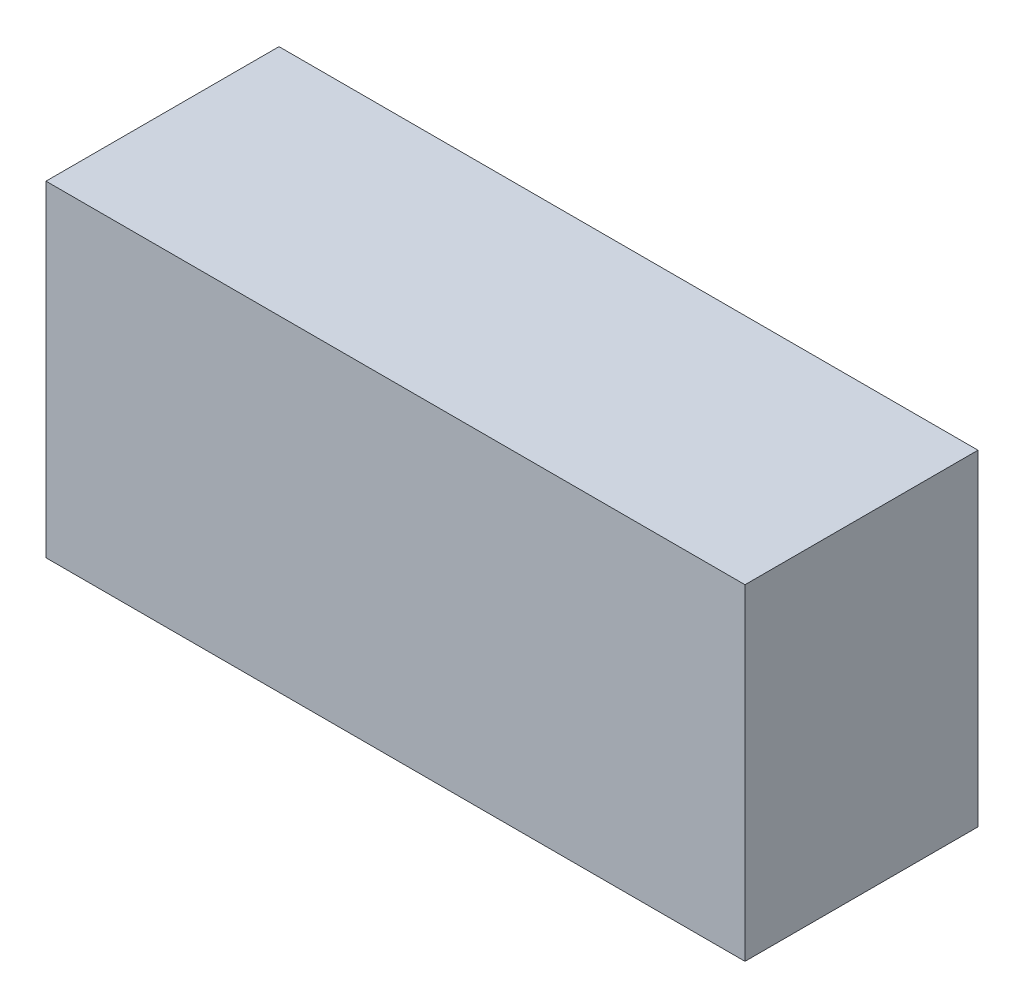
ISO-10303-21;
HEADER;
FILE_DESCRIPTION(('STEP AP214'),'2;1');
FILE_NAME('part.step','',(''),(''),'','','');
FILE_SCHEMA(('AUTOMOTIVE_DESIGN { 1 0 10303 214 1 1 1 1 }'));
ENDSEC;
DATA;
#1=APPLICATION_CONTEXT('core data for automotive mechanical design processes');
#2=APPLICATION_PROTOCOL_DEFINITION('international standard','automotive_design',2000,#1);
#3=PRODUCT_CONTEXT('',#1,'mechanical');
#4=PRODUCT('Part','Part','',(#3));
#5=PRODUCT_RELATED_PRODUCT_CATEGORY('part','',(#4));
#6=PRODUCT_DEFINITION_FORMATION('','',#4);
#7=PRODUCT_DEFINITION_CONTEXT('part definition',#1,'design');
#8=PRODUCT_DEFINITION('design','',#6,#7);
#9=PRODUCT_DEFINITION_SHAPE('','',#8);
#10=(LENGTH_UNIT() NAMED_UNIT(*) SI_UNIT(.MILLI.,.METRE.));
#11=(NAMED_UNIT(*) PLANE_ANGLE_UNIT() SI_UNIT($,.RADIAN.));
#12=(NAMED_UNIT(*) SI_UNIT($,.STERADIAN.) SOLID_ANGLE_UNIT());
#13=UNCERTAINTY_MEASURE_WITH_UNIT(LENGTH_MEASURE(1.E-05),#10,'distance_accuracy_value','');
#14=(GEOMETRIC_REPRESENTATION_CONTEXT(3) GLOBAL_UNCERTAINTY_ASSIGNED_CONTEXT((#13)) GLOBAL_UNIT_ASSIGNED_CONTEXT((#10,
#11,#12)) REPRESENTATION_CONTEXT('',''));
#15=CARTESIAN_POINT('',(0.,0.,0.));
#16=DIRECTION('',(0.,0.,1.));
#17=DIRECTION('',(1.,0.,0.));
#18=AXIS2_PLACEMENT_3D('',#15,#16,#17);
#19=CARTESIAN_POINT('',(1.49999954,0.70000114,0.));
#20=DIRECTION('',(0.,-1.,0.));
#21=DIRECTION('',(-1.,0.,0.));
#22=AXIS2_PLACEMENT_3D('',#19,#20,#21);
#23=PLANE('',#22);
#24=DIRECTION('',(-1.,0.,0.));
#25=VECTOR('',#24,1.);
#26=CARTESIAN_POINT('',(1.49999954,0.70000114,0.));
#27=LINE('',#26,#25);
#28=CARTESIAN_POINT('',(1.49999954,0.70000114,0.));
#29=VERTEX_POINT('',#28);
#30=CARTESIAN_POINT('',(-1.49999954,0.70000114,0.));
#31=VERTEX_POINT('',#30);
#32=EDGE_CURVE('E11',#29,#31,#27,.T.);
#33=ORIENTED_EDGE('',*,*,#32,.T.);
#34=DIRECTION('',(0.,0.,1.));
#35=VECTOR('',#34,1.);
#36=CARTESIAN_POINT('',(-1.49999954,0.70000114,0.));
#37=LINE('',#36,#35);
#38=CARTESIAN_POINT('',(-1.49999954,0.70000114,1.00000054));
#39=VERTEX_POINT('',#38);
#40=EDGE_CURVE('E24',#31,#39,#37,.T.);
#41=ORIENTED_EDGE('',*,*,#40,.T.);
#42=DIRECTION('',(-1.,0.,0.));
#43=VECTOR('',#42,1.);
#44=CARTESIAN_POINT('',(1.49999954,0.70000114,1.00000054));
#45=LINE('',#44,#43);
#46=CARTESIAN_POINT('',(1.49999954,0.70000114,1.00000054));
#47=VERTEX_POINT('',#46);
#48=EDGE_CURVE('E87',#47,#39,#45,.T.);
#49=ORIENTED_EDGE('',*,*,#48,.F.);
#50=DIRECTION('',(0.,0.,1.));
#51=VECTOR('',#50,1.);
#52=CARTESIAN_POINT('',(1.49999954,0.70000114,0.));
#53=LINE('',#52,#51);
#54=EDGE_CURVE('E36',#29,#47,#53,.T.);
#55=ORIENTED_EDGE('',*,*,#54,.F.);
#56=EDGE_LOOP('',(#33,#41,#49,#55));
#57=FACE_BOUND('',#56,.T.);
#58=ADVANCED_FACE('F17',(#57),#23,.F.);
#59=CARTESIAN_POINT('',(-1.49999954,0.70000114,0.));
#60=DIRECTION('',(1.,0.,0.));
#61=DIRECTION('',(0.,-1.,0.));
#62=AXIS2_PLACEMENT_3D('',#59,#60,#61);
#63=PLANE('',#62);
#64=DIRECTION('',(0.,-1.,0.));
#65=VECTOR('',#64,1.);
#66=CARTESIAN_POINT('',(-1.49999954,0.70000114,0.));
#67=LINE('',#66,#65);
#68=CARTESIAN_POINT('',(-1.49999954,-0.6999986,0.));
#69=VERTEX_POINT('',#68);
#70=EDGE_CURVE('E84',#31,#69,#67,.T.);
#71=ORIENTED_EDGE('',*,*,#70,.T.);
#72=DIRECTION('',(0.,0.,1.));
#73=VECTOR('',#72,1.);
#74=CARTESIAN_POINT('',(-1.49999954,-0.6999986,0.));
#75=LINE('',#74,#73);
#76=CARTESIAN_POINT('',(-1.49999954,-0.6999986,1.00000054));
#77=VERTEX_POINT('',#76);
#78=EDGE_CURVE('E82',#69,#77,#75,.T.);
#79=ORIENTED_EDGE('',*,*,#78,.T.);
#80=DIRECTION('',(0.,-1.,0.));
#81=VECTOR('',#80,1.);
#82=CARTESIAN_POINT('',(-1.49999954,0.70000114,1.00000054));
#83=LINE('',#82,#81);
#84=EDGE_CURVE('E62',#39,#77,#83,.T.);
#85=ORIENTED_EDGE('',*,*,#84,.F.);
#86=ORIENTED_EDGE('',*,*,#40,.F.);
#87=EDGE_LOOP('',(#71,#79,#85,#86));
#88=FACE_BOUND('',#87,.T.);
#89=ADVANCED_FACE('F89',(#88),#63,.F.);
#90=CARTESIAN_POINT('',(-1.49999954,-0.6999986,0.));
#91=DIRECTION('',(0.,1.,0.));
#92=DIRECTION('',(1.,0.,0.));
#93=AXIS2_PLACEMENT_3D('',#90,#91,#92);
#94=PLANE('',#93);
#95=DIRECTION('',(1.,0.,0.));
#96=VECTOR('',#95,1.);
#97=CARTESIAN_POINT('',(-1.49999954,-0.6999986,0.));
#98=LINE('',#97,#96);
#99=CARTESIAN_POINT('',(1.49999954,-0.6999986,0.));
#100=VERTEX_POINT('',#99);
#101=EDGE_CURVE('E71',#69,#100,#98,.T.);
#102=ORIENTED_EDGE('',*,*,#101,.T.);
#103=DIRECTION('',(0.,0.,1.));
#104=VECTOR('',#103,1.);
#105=CARTESIAN_POINT('',(1.49999954,-0.6999986,0.));
#106=LINE('',#105,#104);
#107=CARTESIAN_POINT('',(1.49999954,-0.6999986,1.00000054));
#108=VERTEX_POINT('',#107);
#109=EDGE_CURVE('E65',#100,#108,#106,.T.);
#110=ORIENTED_EDGE('',*,*,#109,.T.);
#111=DIRECTION('',(1.,0.,0.));
#112=VECTOR('',#111,1.);
#113=CARTESIAN_POINT('',(-1.49999954,-0.6999986,1.00000054));
#114=LINE('',#113,#112);
#115=EDGE_CURVE('E57',#77,#108,#114,.T.);
#116=ORIENTED_EDGE('',*,*,#115,.F.);
#117=ORIENTED_EDGE('',*,*,#78,.F.);
#118=EDGE_LOOP('',(#102,#110,#116,#117));
#119=FACE_BOUND('',#118,.T.);
#120=ADVANCED_FACE('F69',(#119),#94,.F.);
#121=CARTESIAN_POINT('',(1.49999954,-0.6999986,0.));
#122=DIRECTION('',(-1.,0.,0.));
#123=DIRECTION('',(0.,1.,0.));
#124=AXIS2_PLACEMENT_3D('',#121,#122,#123);
#125=PLANE('',#124);
#126=DIRECTION('',(0.,1.,0.));
#127=VECTOR('',#126,1.);
#128=CARTESIAN_POINT('',(1.49999954,-0.6999986,0.));
#129=LINE('',#128,#127);
#130=EDGE_CURVE('E66',#100,#29,#129,.T.);
#131=ORIENTED_EDGE('',*,*,#130,.T.);
#132=ORIENTED_EDGE('',*,*,#54,.T.);
#133=DIRECTION('',(0.,1.,0.));
#134=VECTOR('',#133,1.);
#135=CARTESIAN_POINT('',(1.49999954,-0.6999986,1.00000054));
#136=LINE('',#135,#134);
#137=EDGE_CURVE('E61',#108,#47,#136,.T.);
#138=ORIENTED_EDGE('',*,*,#137,.F.);
#139=ORIENTED_EDGE('',*,*,#109,.F.);
#140=EDGE_LOOP('',(#131,#132,#138,#139));
#141=FACE_BOUND('',#140,.T.);
#142=ADVANCED_FACE('F76',(#141),#125,.F.);
#143=CARTESIAN_POINT('',(1.49999954,0.70000114,0.));
#144=DIRECTION('',(0.,0.,-1.));
#145=DIRECTION('',(-1.,0.,0.));
#146=AXIS2_PLACEMENT_3D('',#143,#144,#145);
#147=PLANE('',#146);
#148=ORIENTED_EDGE('',*,*,#130,.F.);
#149=ORIENTED_EDGE('',*,*,#101,.F.);
#150=ORIENTED_EDGE('',*,*,#70,.F.);
#151=ORIENTED_EDGE('',*,*,#32,.F.);
#152=EDGE_LOOP('',(#148,#149,#150,#151));
#153=FACE_BOUND('',#152,.T.);
#154=ADVANCED_FACE('F91',(#153),#147,.T.);
#155=CARTESIAN_POINT('',(1.49999954,0.70000114,1.00000054));
#156=DIRECTION('',(0.,0.,-1.));
#157=DIRECTION('',(-1.,0.,0.));
#158=AXIS2_PLACEMENT_3D('',#155,#156,#157);
#159=PLANE('',#158);
#160=ORIENTED_EDGE('',*,*,#48,.T.);
#161=ORIENTED_EDGE('',*,*,#84,.T.);
#162=ORIENTED_EDGE('',*,*,#115,.T.);
#163=ORIENTED_EDGE('',*,*,#137,.T.);
#164=EDGE_LOOP('',(#160,#161,#162,#163));
#165=FACE_BOUND('',#164,.T.);
#166=ADVANCED_FACE('F59',(#165),#159,.F.);
#167=CLOSED_SHELL('',(#58,#89,#120,#142,#154,#166));
#168=MANIFOLD_SOLID_BREP('B1',#167);
#169=ADVANCED_BREP_SHAPE_REPRESENTATION('',(#18,#168),#14);
#170=SHAPE_DEFINITION_REPRESENTATION(#9,#169);
ENDSEC;
END-ISO-10303-21;
